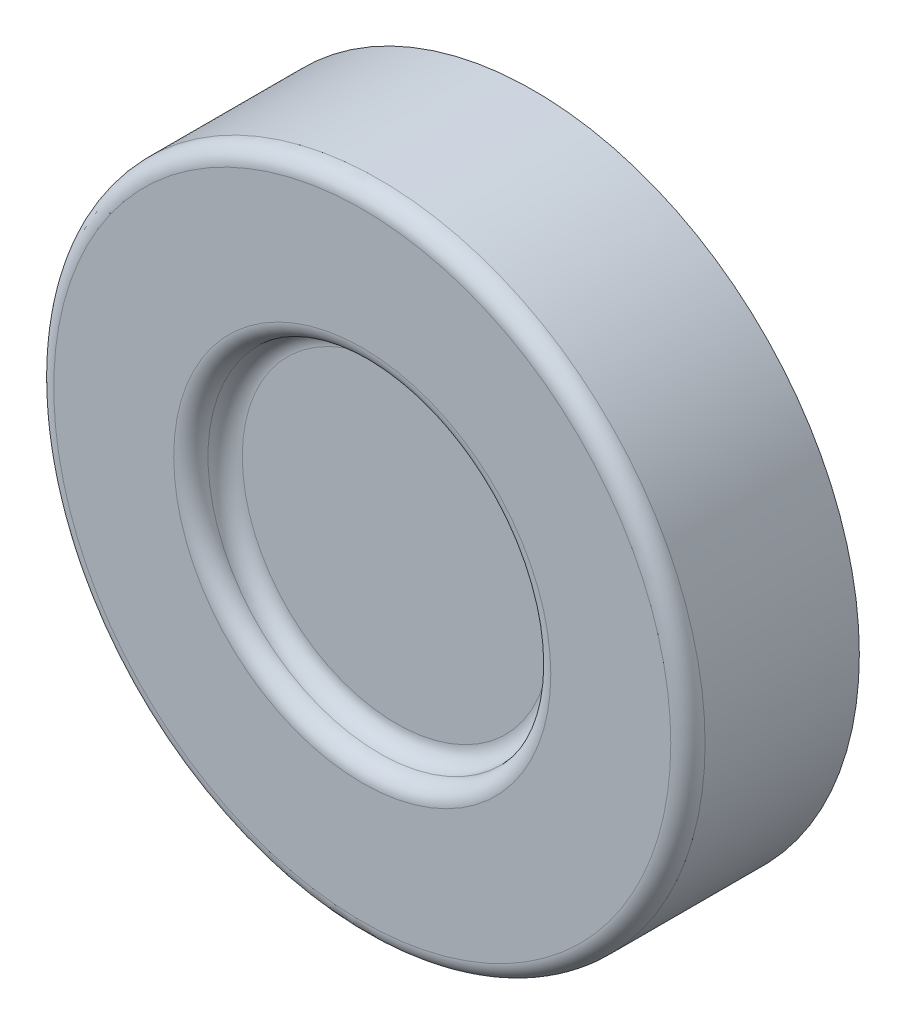
ISO-10303-21;
HEADER;
FILE_DESCRIPTION(('STEP AP214'),'2;1');
FILE_NAME('part.step','',(''),(''),'','','');
FILE_SCHEMA(('AUTOMOTIVE_DESIGN { 1 0 10303 214 1 1 1 1 }'));
ENDSEC;
DATA;
#1=APPLICATION_CONTEXT('core data for automotive mechanical design processes');
#2=APPLICATION_PROTOCOL_DEFINITION('international standard','automotive_design',2000,#1);
#3=PRODUCT_CONTEXT('',#1,'mechanical');
#4=PRODUCT('Part','Part','',(#3));
#5=PRODUCT_RELATED_PRODUCT_CATEGORY('part','',(#4));
#6=PRODUCT_DEFINITION_FORMATION('','',#4);
#7=PRODUCT_DEFINITION_CONTEXT('part definition',#1,'design');
#8=PRODUCT_DEFINITION('design','',#6,#7);
#9=PRODUCT_DEFINITION_SHAPE('','',#8);
#10=(LENGTH_UNIT() NAMED_UNIT(*) SI_UNIT(.MILLI.,.METRE.));
#11=(NAMED_UNIT(*) PLANE_ANGLE_UNIT() SI_UNIT($,.RADIAN.));
#12=(NAMED_UNIT(*) SI_UNIT($,.STERADIAN.) SOLID_ANGLE_UNIT());
#13=UNCERTAINTY_MEASURE_WITH_UNIT(LENGTH_MEASURE(1.E-05),#10,'distance_accuracy_value','');
#14=(GEOMETRIC_REPRESENTATION_CONTEXT(3) GLOBAL_UNCERTAINTY_ASSIGNED_CONTEXT((#13)) GLOBAL_UNIT_ASSIGNED_CONTEXT((#10,
#11,#12)) REPRESENTATION_CONTEXT('',''));
#15=CARTESIAN_POINT('',(0.,0.,0.));
#16=DIRECTION('',(0.,0.,1.));
#17=DIRECTION('',(1.,0.,0.));
#18=AXIS2_PLACEMENT_3D('',#15,#16,#17);
#19=CARTESIAN_POINT('',(0.,0.,10.));
#20=DIRECTION('',(0.,0.,-1.));
#21=DIRECTION('',(-1.,0.,0.));
#22=AXIS2_PLACEMENT_3D('',#19,#20,#21);
#23=CYLINDRICAL_SURFACE('',#22,19.);
#24=CARTESIAN_POINT('',(0.,0.,9.));
#25=DIRECTION('',(0.,0.,1.));
#26=DIRECTION('',(1.,0.,0.));
#27=AXIS2_PLACEMENT_3D('',#24,#25,#26);
#28=CIRCLE('',#27,19.);
#29=CARTESIAN_POINT('',(19.,0.,9.));
#30=VERTEX_POINT('',#29);
#31=EDGE_CURVE('E10',#30,#30,#28,.F.);
#32=ORIENTED_EDGE('',*,*,#31,.T.);
#33=EDGE_LOOP('',(#32));
#34=FACE_BOUND('',#33,.T.);
#35=CARTESIAN_POINT('',(0.,0.,0.));
#36=DIRECTION('',(0.,0.,1.));
#37=DIRECTION('',(1.,0.,0.));
#38=AXIS2_PLACEMENT_3D('',#35,#36,#37);
#39=CIRCLE('',#38,19.);
#40=CARTESIAN_POINT('',(19.,0.,0.));
#41=VERTEX_POINT('',#40);
#42=EDGE_CURVE('E57',#41,#41,#39,.T.);
#43=ORIENTED_EDGE('',*,*,#42,.T.);
#44=EDGE_LOOP('',(#43));
#45=FACE_BOUND('',#44,.T.);
#46=ADVANCED_FACE('F35',(#34,#45),#23,.T.);
#47=CARTESIAN_POINT('',(0.,0.,10.));
#48=DIRECTION('',(0.,0.,1.));
#49=DIRECTION('',(1.,0.,0.));
#50=AXIS2_PLACEMENT_3D('',#47,#48,#49);
#51=PLANE('',#50);
#52=CARTESIAN_POINT('',(0.,0.,10.));
#53=DIRECTION('',(0.,0.,1.));
#54=DIRECTION('',(1.,0.,0.));
#55=AXIS2_PLACEMENT_3D('',#52,#53,#54);
#56=CIRCLE('',#55,11.);
#57=CARTESIAN_POINT('',(11.,0.,10.));
#58=VERTEX_POINT('',#57);
#59=EDGE_CURVE('E44',#58,#58,#56,.F.);
#60=ORIENTED_EDGE('',*,*,#59,.T.);
#61=EDGE_LOOP('',(#60));
#62=FACE_BOUND('',#61,.T.);
#63=CARTESIAN_POINT('',(0.,0.,10.));
#64=DIRECTION('',(0.,0.,1.));
#65=DIRECTION('',(1.,0.,0.));
#66=AXIS2_PLACEMENT_3D('',#63,#64,#65);
#67=CIRCLE('',#66,18.);
#68=CARTESIAN_POINT('',(18.,0.,10.));
#69=VERTEX_POINT('',#68);
#70=EDGE_CURVE('E49',#69,#69,#67,.T.);
#71=ORIENTED_EDGE('',*,*,#70,.T.);
#72=EDGE_LOOP('',(#71));
#73=FACE_BOUND('',#72,.T.);
#74=ADVANCED_FACE('F82',(#62,#73),#51,.T.);
#75=CARTESIAN_POINT('',(0.,0.,0.));
#76=DIRECTION('',(0.,0.,1.));
#77=DIRECTION('',(1.,0.,0.));
#78=AXIS2_PLACEMENT_3D('',#75,#76,#77);
#79=PLANE('',#78);
#80=ORIENTED_EDGE('',*,*,#42,.F.);
#81=EDGE_LOOP('',(#80));
#82=FACE_BOUND('',#81,.T.);
#83=ADVANCED_FACE('F77',(#82),#79,.F.);
#84=CARTESIAN_POINT('',(0.,0.,8.));
#85=DIRECTION('',(0.,0.,1.));
#86=DIRECTION('',(1.,0.,0.));
#87=AXIS2_PLACEMENT_3D('',#84,#85,#86);
#88=PLANE('',#87);
#89=CARTESIAN_POINT('',(0.,0.,8.));
#90=DIRECTION('',(0.,0.,1.));
#91=DIRECTION('',(1.,0.,0.));
#92=AXIS2_PLACEMENT_3D('',#89,#90,#91);
#93=CIRCLE('',#92,9.);
#94=CARTESIAN_POINT('',(9.,0.,8.));
#95=VERTEX_POINT('',#94);
#96=EDGE_CURVE('E54',#95,#95,#93,.T.);
#97=ORIENTED_EDGE('',*,*,#96,.T.);
#98=EDGE_LOOP('',(#97));
#99=FACE_BOUND('',#98,.T.);
#100=ADVANCED_FACE('F70',(#99),#88,.T.);
#101=CARTESIAN_POINT('',(0.,0.,9.));
#102=DIRECTION('',(0.,0.,1.));
#103=DIRECTION('',(1.,0.,0.));
#104=AXIS2_PLACEMENT_3D('',#101,#102,#103);
#105=TOROIDAL_SURFACE('',#104,11.,1.);
#106=ORIENTED_EDGE('',*,*,#59,.F.);
#107=EDGE_LOOP('',(#106));
#108=FACE_BOUND('',#107,.T.);
#109=CARTESIAN_POINT('',(0.,0.,9.));
#110=DIRECTION('',(0.,0.,1.));
#111=DIRECTION('',(1.,0.,0.));
#112=AXIS2_PLACEMENT_3D('',#109,#110,#111);
#113=CIRCLE('',#112,10.);
#114=CARTESIAN_POINT('',(10.,0.,9.));
#115=VERTEX_POINT('',#114);
#116=EDGE_CURVE('E39',#115,#115,#113,.T.);
#117=ORIENTED_EDGE('',*,*,#116,.F.);
#118=EDGE_LOOP('',(#117));
#119=FACE_BOUND('',#118,.T.);
#120=ADVANCED_FACE('F68',(#108,#119),#105,.T.);
#121=CARTESIAN_POINT('',(0.,0.,9.));
#122=DIRECTION('',(0.,0.,1.));
#123=DIRECTION('',(1.,0.,0.));
#124=AXIS2_PLACEMENT_3D('',#121,#122,#123);
#125=TOROIDAL_SURFACE('',#124,9.,1.);
#126=ORIENTED_EDGE('',*,*,#116,.T.);
#127=EDGE_LOOP('',(#126));
#128=FACE_BOUND('',#127,.T.);
#129=ORIENTED_EDGE('',*,*,#96,.F.);
#130=EDGE_LOOP('',(#129));
#131=FACE_BOUND('',#130,.T.);
#132=ADVANCED_FACE('F65',(#128,#131),#125,.F.);
#133=CARTESIAN_POINT('',(0.,0.,9.));
#134=DIRECTION('',(0.,0.,1.));
#135=DIRECTION('',(1.,0.,0.));
#136=AXIS2_PLACEMENT_3D('',#133,#134,#135);
#137=TOROIDAL_SURFACE('',#136,18.,1.);
#138=ORIENTED_EDGE('',*,*,#31,.F.);
#139=EDGE_LOOP('',(#138));
#140=FACE_BOUND('',#139,.T.);
#141=ORIENTED_EDGE('',*,*,#70,.F.);
#142=EDGE_LOOP('',(#141));
#143=FACE_BOUND('',#142,.T.);
#144=ADVANCED_FACE('F37',(#140,#143),#137,.T.);
#145=CLOSED_SHELL('',(#46,#74,#83,#100,#120,#132,#144));
#146=MANIFOLD_SOLID_BREP('B2',#145);
#147=ADVANCED_BREP_SHAPE_REPRESENTATION('',(#18,#146),#14);
#148=SHAPE_DEFINITION_REPRESENTATION(#9,#147);
ENDSEC;
END-ISO-10303-21;
